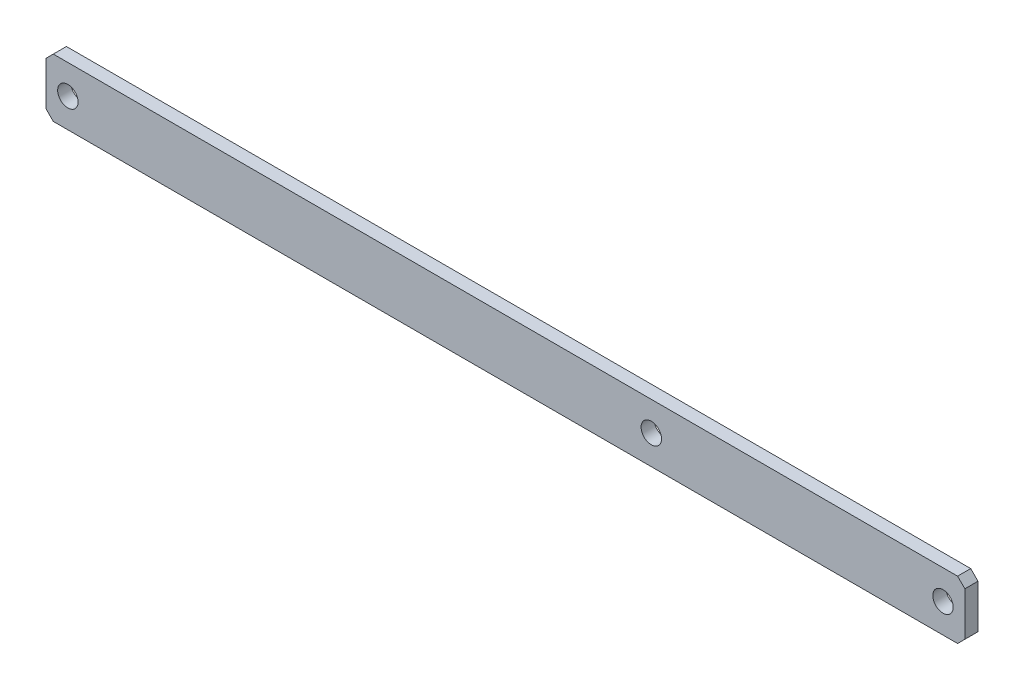
ISO-10303-21;
HEADER;
FILE_DESCRIPTION(('STEP AP214'),'2;1');
FILE_NAME('part.step','',(''),(''),'','','');
FILE_SCHEMA(('AUTOMOTIVE_DESIGN { 1 0 10303 214 1 1 1 1 }'));
ENDSEC;
DATA;
#1=APPLICATION_CONTEXT('core data for automotive mechanical design processes');
#2=APPLICATION_PROTOCOL_DEFINITION('international standard','automotive_design',2000,#1);
#3=PRODUCT_CONTEXT('',#1,'mechanical');
#4=PRODUCT('Part','Part','',(#3));
#5=PRODUCT_RELATED_PRODUCT_CATEGORY('part','',(#4));
#6=PRODUCT_DEFINITION_FORMATION('','',#4);
#7=PRODUCT_DEFINITION_CONTEXT('part definition',#1,'design');
#8=PRODUCT_DEFINITION('design','',#6,#7);
#9=PRODUCT_DEFINITION_SHAPE('','',#8);
#10=(LENGTH_UNIT() NAMED_UNIT(*) SI_UNIT(.MILLI.,.METRE.));
#11=(NAMED_UNIT(*) PLANE_ANGLE_UNIT() SI_UNIT($,.RADIAN.));
#12=(NAMED_UNIT(*) SI_UNIT($,.STERADIAN.) SOLID_ANGLE_UNIT());
#13=UNCERTAINTY_MEASURE_WITH_UNIT(LENGTH_MEASURE(1.E-05),#10,'distance_accuracy_value','');
#14=(GEOMETRIC_REPRESENTATION_CONTEXT(3) GLOBAL_UNCERTAINTY_ASSIGNED_CONTEXT((#13)) GLOBAL_UNIT_ASSIGNED_CONTEXT((#10,
#11,#12)) REPRESENTATION_CONTEXT('',''));
#15=CARTESIAN_POINT('',(0.,0.,0.));
#16=DIRECTION('',(0.,0.,1.));
#17=DIRECTION('',(1.,0.,0.));
#18=AXIS2_PLACEMENT_3D('',#15,#16,#17);
#19=CARTESIAN_POINT('',(0.,0.,9.));
#20=DIRECTION('',(0.,0.,-1.));
#21=DIRECTION('',(-1.,0.,0.));
#22=AXIS2_PLACEMENT_3D('',#19,#20,#21);
#23=PLANE('',#22);
#24=CARTESIAN_POINT('',(200.,0.,9.));
#25=DIRECTION('',(0.,0.,-1.));
#26=DIRECTION('',(-1.,0.,0.));
#27=AXIS2_PLACEMENT_3D('',#24,#25,#26);
#28=CIRCLE('',#27,7.00000000000001);
#29=CARTESIAN_POINT('',(193.,0.,9.));
#30=VERTEX_POINT('',#29);
#31=EDGE_CURVE('E115',#30,#30,#28,.T.);
#32=ORIENTED_EDGE('',*,*,#31,.T.);
#33=EDGE_LOOP('',(#32));
#34=FACE_BOUND('',#33,.T.);
#35=CARTESIAN_POINT('',(0.,0.,9.));
#36=DIRECTION('',(0.,0.,-1.));
#37=DIRECTION('',(-1.,0.,0.));
#38=AXIS2_PLACEMENT_3D('',#35,#36,#37);
#39=CIRCLE('',#38,7.);
#40=CARTESIAN_POINT('',(-7.,0.,9.));
#41=VERTEX_POINT('',#40);
#42=EDGE_CURVE('E21',#41,#41,#39,.T.);
#43=ORIENTED_EDGE('',*,*,#42,.T.);
#44=EDGE_LOOP('',(#43));
#45=FACE_BOUND('',#44,.T.);
#46=CARTESIAN_POINT('',(-400.,0.,9.));
#47=DIRECTION('',(0.,0.,-1.));
#48=DIRECTION('',(-1.,0.,0.));
#49=AXIS2_PLACEMENT_3D('',#46,#47,#48);
#50=CIRCLE('',#49,7.00000000000001);
#51=CARTESIAN_POINT('',(-407.,0.,9.));
#52=VERTEX_POINT('',#51);
#53=EDGE_CURVE('E117',#52,#52,#50,.T.);
#54=ORIENTED_EDGE('',*,*,#53,.T.);
#55=EDGE_LOOP('',(#54));
#56=FACE_BOUND('',#55,.T.);
#57=DIRECTION('',(0.,1.,0.));
#58=VECTOR('',#57,1.);
#59=CARTESIAN_POINT('',(-415.,-15.,9.));
#60=LINE('',#59,#58);
#61=CARTESIAN_POINT('',(-415.,15.,9.));
#62=VERTEX_POINT('',#61);
#63=CARTESIAN_POINT('',(-415.,-15.,9.));
#64=VERTEX_POINT('',#63);
#65=EDGE_CURVE('E121',#62,#64,#60,.F.);
#66=ORIENTED_EDGE('',*,*,#65,.T.);
#67=DIRECTION('',(-0.707106781186552,0.707106781186543,0.));
#68=VECTOR('',#67,1.);
#69=CARTESIAN_POINT('',(-415.,-15.,9.));
#70=LINE('',#69,#68);
#71=CARTESIAN_POINT('',(-410.,-20.,9.));
#72=VERTEX_POINT('',#71);
#73=EDGE_CURVE('E130',#64,#72,#70,.F.);
#74=ORIENTED_EDGE('',*,*,#73,.T.);
#75=DIRECTION('',(1.,0.,0.));
#76=VECTOR('',#75,1.);
#77=CARTESIAN_POINT('',(0.,-20.,9.));
#78=LINE('',#77,#76);
#79=CARTESIAN_POINT('',(210.,-20.,9.));
#80=VERTEX_POINT('',#79);
#81=EDGE_CURVE('E134',#72,#80,#78,.T.);
#82=ORIENTED_EDGE('',*,*,#81,.T.);
#83=DIRECTION('',(-0.707106781186544,-0.707106781186551,0.));
#84=VECTOR('',#83,1.);
#85=CARTESIAN_POINT('',(210.,-20.,9.));
#86=LINE('',#85,#84);
#87=CARTESIAN_POINT('',(215.,-15.,9.));
#88=VERTEX_POINT('',#87);
#89=EDGE_CURVE('E138',#80,#88,#86,.F.);
#90=ORIENTED_EDGE('',*,*,#89,.T.);
#91=DIRECTION('',(0.,1.,0.));
#92=VECTOR('',#91,1.);
#93=CARTESIAN_POINT('',(215.,15.,9.));
#94=LINE('',#93,#92);
#95=CARTESIAN_POINT('',(215.,15.,9.));
#96=VERTEX_POINT('',#95);
#97=EDGE_CURVE('E142',#88,#96,#94,.T.);
#98=ORIENTED_EDGE('',*,*,#97,.T.);
#99=DIRECTION('',(0.707106781186544,-0.707106781186551,0.));
#100=VECTOR('',#99,1.);
#101=CARTESIAN_POINT('',(210.,20.,9.));
#102=LINE('',#101,#100);
#103=CARTESIAN_POINT('',(210.,20.,9.));
#104=VERTEX_POINT('',#103);
#105=EDGE_CURVE('E81',#96,#104,#102,.F.);
#106=ORIENTED_EDGE('',*,*,#105,.T.);
#107=DIRECTION('',(1.,0.,0.));
#108=VECTOR('',#107,1.);
#109=CARTESIAN_POINT('',(-410.,20.,9.));
#110=LINE('',#109,#108);
#111=CARTESIAN_POINT('',(-410.,20.,9.));
#112=VERTEX_POINT('',#111);
#113=EDGE_CURVE('E83',#104,#112,#110,.F.);
#114=ORIENTED_EDGE('',*,*,#113,.T.);
#115=DIRECTION('',(0.707106781186552,0.707106781186543,0.));
#116=VECTOR('',#115,1.);
#117=CARTESIAN_POINT('',(-415.,15.,9.));
#118=LINE('',#117,#116);
#119=EDGE_CURVE('E85',#112,#62,#118,.F.);
#120=ORIENTED_EDGE('',*,*,#119,.T.);
#121=EDGE_LOOP('',(#66,#74,#82,#90,#98,#106,#114,#120));
#122=FACE_BOUND('',#121,.T.);
#123=ADVANCED_FACE('F18',(#34,#45,#56,#122),#23,.F.);
#124=CARTESIAN_POINT('',(0.,0.,9.));
#125=DIRECTION('',(0.,0.,-1.));
#126=DIRECTION('',(-1.,0.,0.));
#127=AXIS2_PLACEMENT_3D('',#124,#125,#126);
#128=CYLINDRICAL_SURFACE('',#127,7.);
#129=ORIENTED_EDGE('',*,*,#42,.F.);
#130=EDGE_LOOP('',(#129));
#131=FACE_BOUND('',#130,.T.);
#132=CARTESIAN_POINT('',(0.,0.,0.));
#133=DIRECTION('',(0.,0.,-1.));
#134=DIRECTION('',(-1.,0.,0.));
#135=AXIS2_PLACEMENT_3D('',#132,#133,#134);
#136=CIRCLE('',#135,7.);
#137=CARTESIAN_POINT('',(-7.,0.,0.));
#138=VERTEX_POINT('',#137);
#139=EDGE_CURVE('E111',#138,#138,#136,.F.);
#140=ORIENTED_EDGE('',*,*,#139,.F.);
#141=EDGE_LOOP('',(#140));
#142=FACE_BOUND('',#141,.T.);
#143=ADVANCED_FACE('F283',(#131,#142),#128,.F.);
#144=CARTESIAN_POINT('',(-415.,15.,9.));
#145=DIRECTION('',(0.707106781186543,-0.707106781186552,0.));
#146=DIRECTION('',(0.707106781186552,0.707106781186543,0.));
#147=AXIS2_PLACEMENT_3D('',#144,#145,#146);
#148=PLANE('',#147);
#149=DIRECTION('',(0.,0.,-1.));
#150=VECTOR('',#149,1.);
#151=CARTESIAN_POINT('',(-415.,15.,9.));
#152=LINE('',#151,#150);
#153=CARTESIAN_POINT('',(-415.,15.,0.));
#154=VERTEX_POINT('',#153);
#155=EDGE_CURVE('E96',#154,#62,#152,.F.);
#156=ORIENTED_EDGE('',*,*,#155,.T.);
#157=ORIENTED_EDGE('',*,*,#119,.F.);
#158=DIRECTION('',(0.,0.,-1.));
#159=VECTOR('',#158,1.);
#160=CARTESIAN_POINT('',(-410.,20.,9.));
#161=LINE('',#160,#159);
#162=CARTESIAN_POINT('',(-410.,20.,0.));
#163=VERTEX_POINT('',#162);
#164=EDGE_CURVE('E90',#112,#163,#161,.T.);
#165=ORIENTED_EDGE('',*,*,#164,.T.);
#166=DIRECTION('',(0.707106781186552,0.707106781186543,0.));
#167=VECTOR('',#166,1.);
#168=CARTESIAN_POINT('',(-415.,15.,0.));
#169=LINE('',#168,#167);
#170=EDGE_CURVE('E114',#154,#163,#169,.T.);
#171=ORIENTED_EDGE('',*,*,#170,.F.);
#172=EDGE_LOOP('',(#156,#157,#165,#171));
#173=FACE_BOUND('',#172,.T.);
#174=ADVANCED_FACE('F93',(#173),#148,.F.);
#175=CARTESIAN_POINT('',(-410.,20.,9.));
#176=DIRECTION('',(0.,-1.,0.));
#177=DIRECTION('',(0.,0.,-1.));
#178=AXIS2_PLACEMENT_3D('',#175,#176,#177);
#179=PLANE('',#178);
#180=ORIENTED_EDGE('',*,*,#164,.F.);
#181=ORIENTED_EDGE('',*,*,#113,.F.);
#182=DIRECTION('',(0.,0.,1.));
#183=VECTOR('',#182,1.);
#184=CARTESIAN_POINT('',(210.,20.,9.));
#185=LINE('',#184,#183);
#186=CARTESIAN_POINT('',(210.,20.,0.));
#187=VERTEX_POINT('',#186);
#188=EDGE_CURVE('E104',#104,#187,#185,.F.);
#189=ORIENTED_EDGE('',*,*,#188,.T.);
#190=DIRECTION('',(-1.,0.,0.));
#191=VECTOR('',#190,1.);
#192=CARTESIAN_POINT('',(0.,20.,0.));
#193=LINE('',#192,#191);
#194=EDGE_CURVE('E101',#163,#187,#193,.F.);
#195=ORIENTED_EDGE('',*,*,#194,.F.);
#196=EDGE_LOOP('',(#180,#181,#189,#195));
#197=FACE_BOUND('',#196,.T.);
#198=ADVANCED_FACE('F99',(#197),#179,.F.);
#199=CARTESIAN_POINT('',(210.,20.,9.));
#200=DIRECTION('',(-0.707106781186551,-0.707106781186544,0.));
#201=DIRECTION('',(0.707106781186544,-0.707106781186551,0.));
#202=AXIS2_PLACEMENT_3D('',#199,#200,#201);
#203=PLANE('',#202);
#204=ORIENTED_EDGE('',*,*,#188,.F.);
#205=ORIENTED_EDGE('',*,*,#105,.F.);
#206=DIRECTION('',(0.,0.,1.));
#207=VECTOR('',#206,1.);
#208=CARTESIAN_POINT('',(215.,15.,9.));
#209=LINE('',#208,#207);
#210=CARTESIAN_POINT('',(215.,15.,0.));
#211=VERTEX_POINT('',#210);
#212=EDGE_CURVE('E140',#96,#211,#209,.F.);
#213=ORIENTED_EDGE('',*,*,#212,.T.);
#214=DIRECTION('',(0.707106781186542,-0.707106781186553,0.));
#215=VECTOR('',#214,1.);
#216=CARTESIAN_POINT('',(210.,20.,0.));
#217=LINE('',#216,#215);
#218=EDGE_CURVE('E146',#187,#211,#217,.T.);
#219=ORIENTED_EDGE('',*,*,#218,.F.);
#220=EDGE_LOOP('',(#204,#205,#213,#219));
#221=FACE_BOUND('',#220,.T.);
#222=ADVANCED_FACE('F147',(#221),#203,.F.);
#223=CARTESIAN_POINT('',(215.,15.,9.));
#224=DIRECTION('',(-1.,0.,0.));
#225=DIRECTION('',(0.,0.,1.));
#226=AXIS2_PLACEMENT_3D('',#223,#224,#225);
#227=PLANE('',#226);
#228=ORIENTED_EDGE('',*,*,#212,.F.);
#229=ORIENTED_EDGE('',*,*,#97,.F.);
#230=DIRECTION('',(0.,0.,1.));
#231=VECTOR('',#230,1.);
#232=CARTESIAN_POINT('',(215.,-15.,9.));
#233=LINE('',#232,#231);
#234=CARTESIAN_POINT('',(215.,-15.,0.));
#235=VERTEX_POINT('',#234);
#236=EDGE_CURVE('E136',#88,#235,#233,.F.);
#237=ORIENTED_EDGE('',*,*,#236,.T.);
#238=DIRECTION('',(0.,1.,0.));
#239=VECTOR('',#238,1.);
#240=CARTESIAN_POINT('',(215.,0.,0.));
#241=LINE('',#240,#239);
#242=EDGE_CURVE('E152',#211,#235,#241,.F.);
#243=ORIENTED_EDGE('',*,*,#242,.F.);
#244=EDGE_LOOP('',(#228,#229,#237,#243));
#245=FACE_BOUND('',#244,.T.);
#246=ADVANCED_FACE('F184',(#245),#227,.F.);
#247=CARTESIAN_POINT('',(210.,-20.,9.));
#248=DIRECTION('',(-0.707106781186551,0.707106781186544,0.));
#249=DIRECTION('',(-0.707106781186544,-0.707106781186551,0.));
#250=AXIS2_PLACEMENT_3D('',#247,#248,#249);
#251=PLANE('',#250);
#252=ORIENTED_EDGE('',*,*,#236,.F.);
#253=ORIENTED_EDGE('',*,*,#89,.F.);
#254=DIRECTION('',(0.,0.,1.));
#255=VECTOR('',#254,1.);
#256=CARTESIAN_POINT('',(210.,-20.,9.));
#257=LINE('',#256,#255);
#258=CARTESIAN_POINT('',(210.,-20.,0.));
#259=VERTEX_POINT('',#258);
#260=EDGE_CURVE('E132',#80,#259,#257,.F.);
#261=ORIENTED_EDGE('',*,*,#260,.T.);
#262=DIRECTION('',(-0.707106781186542,-0.707106781186553,0.));
#263=VECTOR('',#262,1.);
#264=CARTESIAN_POINT('',(215.,-15.,0.));
#265=LINE('',#264,#263);
#266=EDGE_CURVE('E160',#235,#259,#265,.T.);
#267=ORIENTED_EDGE('',*,*,#266,.F.);
#268=EDGE_LOOP('',(#252,#253,#261,#267));
#269=FACE_BOUND('',#268,.T.);
#270=ADVANCED_FACE('F181',(#269),#251,.F.);
#271=CARTESIAN_POINT('',(0.,-20.,9.));
#272=DIRECTION('',(0.,1.,0.));
#273=DIRECTION('',(0.,0.,1.));
#274=AXIS2_PLACEMENT_3D('',#271,#272,#273);
#275=PLANE('',#274);
#276=ORIENTED_EDGE('',*,*,#260,.F.);
#277=ORIENTED_EDGE('',*,*,#81,.F.);
#278=DIRECTION('',(0.,0.,1.));
#279=VECTOR('',#278,1.);
#280=CARTESIAN_POINT('',(-410.,-20.,9.));
#281=LINE('',#280,#279);
#282=CARTESIAN_POINT('',(-410.,-20.,0.));
#283=VERTEX_POINT('',#282);
#284=EDGE_CURVE('E128',#72,#283,#281,.F.);
#285=ORIENTED_EDGE('',*,*,#284,.T.);
#286=DIRECTION('',(-1.,0.,0.));
#287=VECTOR('',#286,1.);
#288=CARTESIAN_POINT('',(0.,-20.,0.));
#289=LINE('',#288,#287);
#290=EDGE_CURVE('E163',#259,#283,#289,.T.);
#291=ORIENTED_EDGE('',*,*,#290,.F.);
#292=EDGE_LOOP('',(#276,#277,#285,#291));
#293=FACE_BOUND('',#292,.T.);
#294=ADVANCED_FACE('F176',(#293),#275,.F.);
#295=CARTESIAN_POINT('',(-415.,-15.,9.));
#296=DIRECTION('',(0.707106781186543,0.707106781186552,0.));
#297=DIRECTION('',(-0.707106781186552,0.707106781186543,0.));
#298=AXIS2_PLACEMENT_3D('',#295,#296,#297);
#299=PLANE('',#298);
#300=ORIENTED_EDGE('',*,*,#284,.F.);
#301=ORIENTED_EDGE('',*,*,#73,.F.);
#302=DIRECTION('',(0.,0.,-1.));
#303=VECTOR('',#302,1.);
#304=CARTESIAN_POINT('',(-415.,-15.,9.));
#305=LINE('',#304,#303);
#306=CARTESIAN_POINT('',(-415.,-15.,0.));
#307=VERTEX_POINT('',#306);
#308=EDGE_CURVE('E36',#64,#307,#305,.T.);
#309=ORIENTED_EDGE('',*,*,#308,.T.);
#310=DIRECTION('',(-0.707106781186552,0.707106781186543,0.));
#311=VECTOR('',#310,1.);
#312=CARTESIAN_POINT('',(-410.,-20.,0.));
#313=LINE('',#312,#311);
#314=EDGE_CURVE('E166',#283,#307,#313,.T.);
#315=ORIENTED_EDGE('',*,*,#314,.F.);
#316=EDGE_LOOP('',(#300,#301,#309,#315));
#317=FACE_BOUND('',#316,.T.);
#318=ADVANCED_FACE('F172',(#317),#299,.F.);
#319=CARTESIAN_POINT('',(-415.,-15.,9.));
#320=DIRECTION('',(1.,0.,0.));
#321=DIRECTION('',(0.,0.,-1.));
#322=AXIS2_PLACEMENT_3D('',#319,#320,#321);
#323=PLANE('',#322);
#324=ORIENTED_EDGE('',*,*,#308,.F.);
#325=ORIENTED_EDGE('',*,*,#65,.F.);
#326=ORIENTED_EDGE('',*,*,#155,.F.);
#327=DIRECTION('',(0.,1.,0.));
#328=VECTOR('',#327,1.);
#329=CARTESIAN_POINT('',(-415.,0.,0.));
#330=LINE('',#329,#328);
#331=EDGE_CURVE('E110',#307,#154,#330,.T.);
#332=ORIENTED_EDGE('',*,*,#331,.F.);
#333=EDGE_LOOP('',(#324,#325,#326,#332));
#334=FACE_BOUND('',#333,.T.);
#335=ADVANCED_FACE('F169',(#334),#323,.F.);
#336=CARTESIAN_POINT('',(-400.,0.,9.));
#337=DIRECTION('',(0.,0.,-1.));
#338=DIRECTION('',(-1.,0.,0.));
#339=AXIS2_PLACEMENT_3D('',#336,#337,#338);
#340=CYLINDRICAL_SURFACE('',#339,7.00000000000001);
#341=ORIENTED_EDGE('',*,*,#53,.F.);
#342=EDGE_LOOP('',(#341));
#343=FACE_BOUND('',#342,.T.);
#344=CARTESIAN_POINT('',(-400.,0.,0.));
#345=DIRECTION('',(0.,0.,-1.));
#346=DIRECTION('',(-1.,0.,0.));
#347=AXIS2_PLACEMENT_3D('',#344,#345,#346);
#348=CIRCLE('',#347,7.00000000000001);
#349=CARTESIAN_POINT('',(-407.,0.,0.));
#350=VERTEX_POINT('',#349);
#351=EDGE_CURVE('E27',#350,#350,#348,.F.);
#352=ORIENTED_EDGE('',*,*,#351,.F.);
#353=EDGE_LOOP('',(#352));
#354=FACE_BOUND('',#353,.T.);
#355=ADVANCED_FACE('F201',(#343,#354),#340,.F.);
#356=CARTESIAN_POINT('',(200.,0.,9.));
#357=DIRECTION('',(0.,0.,-1.));
#358=DIRECTION('',(-1.,0.,0.));
#359=AXIS2_PLACEMENT_3D('',#356,#357,#358);
#360=CYLINDRICAL_SURFACE('',#359,7.00000000000001);
#361=ORIENTED_EDGE('',*,*,#31,.F.);
#362=EDGE_LOOP('',(#361));
#363=FACE_BOUND('',#362,.T.);
#364=CARTESIAN_POINT('',(200.,0.,0.));
#365=DIRECTION('',(0.,0.,-1.));
#366=DIRECTION('',(-1.,0.,0.));
#367=AXIS2_PLACEMENT_3D('',#364,#365,#366);
#368=CIRCLE('',#367,7.00000000000001);
#369=CARTESIAN_POINT('',(193.,0.,0.));
#370=VERTEX_POINT('',#369);
#371=EDGE_CURVE('E11',#370,#370,#368,.F.);
#372=ORIENTED_EDGE('',*,*,#371,.F.);
#373=EDGE_LOOP('',(#372));
#374=FACE_BOUND('',#373,.T.);
#375=ADVANCED_FACE('F195',(#363,#374),#360,.F.);
#376=CARTESIAN_POINT('',(0.,0.,0.));
#377=DIRECTION('',(0.,0.,-1.));
#378=DIRECTION('',(-1.,0.,0.));
#379=AXIS2_PLACEMENT_3D('',#376,#377,#378);
#380=PLANE('',#379);
#381=ORIENTED_EDGE('',*,*,#371,.T.);
#382=EDGE_LOOP('',(#381));
#383=FACE_BOUND('',#382,.T.);
#384=ORIENTED_EDGE('',*,*,#351,.T.);
#385=EDGE_LOOP('',(#384));
#386=FACE_BOUND('',#385,.T.);
#387=ORIENTED_EDGE('',*,*,#314,.T.);
#388=ORIENTED_EDGE('',*,*,#331,.T.);
#389=ORIENTED_EDGE('',*,*,#170,.T.);
#390=ORIENTED_EDGE('',*,*,#194,.T.);
#391=ORIENTED_EDGE('',*,*,#218,.T.);
#392=ORIENTED_EDGE('',*,*,#242,.T.);
#393=ORIENTED_EDGE('',*,*,#266,.T.);
#394=ORIENTED_EDGE('',*,*,#290,.T.);
#395=EDGE_LOOP('',(#387,#388,#389,#390,#391,#392,#393,#394));
#396=FACE_BOUND('',#395,.T.);
#397=ORIENTED_EDGE('',*,*,#139,.T.);
#398=EDGE_LOOP('',(#397));
#399=FACE_BOUND('',#398,.T.);
#400=ADVANCED_FACE('F155',(#383,#386,#396,#399),#380,.T.);
#401=CLOSED_SHELL('',(#123,#143,#174,#198,#222,#246,#270,#294,#318,#335,#355,#375,#400));
#402=MANIFOLD_SOLID_BREP('B1',#401);
#403=ADVANCED_BREP_SHAPE_REPRESENTATION('',(#18,#402),#14);
#404=SHAPE_DEFINITION_REPRESENTATION(#9,#403);
ENDSEC;
END-ISO-10303-21;
